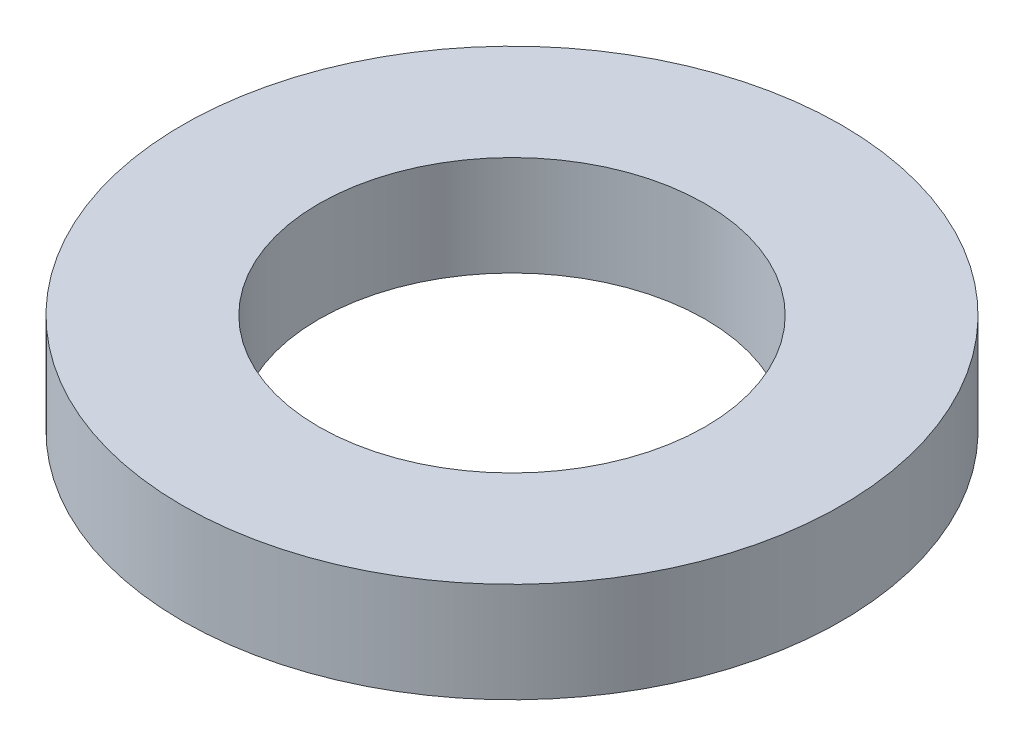
ISO-10303-21;
HEADER;
FILE_DESCRIPTION(('STEP AP214'),'2;1');
FILE_NAME('part.step','',(''),(''),'','','');
FILE_SCHEMA(('AUTOMOTIVE_DESIGN { 1 0 10303 214 1 1 1 1 }'));
ENDSEC;
DATA;
#1=APPLICATION_CONTEXT('core data for automotive mechanical design processes');
#2=APPLICATION_PROTOCOL_DEFINITION('international standard','automotive_design',2000,#1);
#3=PRODUCT_CONTEXT('',#1,'mechanical');
#4=PRODUCT('Part','Part','',(#3));
#5=PRODUCT_RELATED_PRODUCT_CATEGORY('part','',(#4));
#6=PRODUCT_DEFINITION_FORMATION('','',#4);
#7=PRODUCT_DEFINITION_CONTEXT('part definition',#1,'design');
#8=PRODUCT_DEFINITION('design','',#6,#7);
#9=PRODUCT_DEFINITION_SHAPE('','',#8);
#10=(LENGTH_UNIT() NAMED_UNIT(*) SI_UNIT(.MILLI.,.METRE.));
#11=(NAMED_UNIT(*) PLANE_ANGLE_UNIT() SI_UNIT($,.RADIAN.));
#12=(NAMED_UNIT(*) SI_UNIT($,.STERADIAN.) SOLID_ANGLE_UNIT());
#13=UNCERTAINTY_MEASURE_WITH_UNIT(LENGTH_MEASURE(1.E-05),#10,'distance_accuracy_value','');
#14=(GEOMETRIC_REPRESENTATION_CONTEXT(3) GLOBAL_UNCERTAINTY_ASSIGNED_CONTEXT((#13)) GLOBAL_UNIT_ASSIGNED_CONTEXT((#10,
#11,#12)) REPRESENTATION_CONTEXT('',''));
#15=CARTESIAN_POINT('',(0.,0.,0.));
#16=DIRECTION('',(0.,0.,1.));
#17=DIRECTION('',(1.,0.,0.));
#18=AXIS2_PLACEMENT_3D('',#15,#16,#17);
#19=CARTESIAN_POINT('',(0.,22.,0.));
#20=DIRECTION('',(0.,-1.,0.));
#21=DIRECTION('',(0.,0.,-1.));
#22=AXIS2_PLACEMENT_3D('',#19,#20,#21);
#23=CYLINDRICAL_SURFACE('',#22,72.5);
#24=CARTESIAN_POINT('',(0.,22.,0.));
#25=DIRECTION('',(0.,1.,0.));
#26=DIRECTION('',(0.,0.,1.));
#27=AXIS2_PLACEMENT_3D('',#24,#25,#26);
#28=CIRCLE('',#27,72.5);
#29=CARTESIAN_POINT('',(0.,22.,72.5));
#30=VERTEX_POINT('',#29);
#31=EDGE_CURVE('E10',#30,#30,#28,.T.);
#32=ORIENTED_EDGE('',*,*,#31,.F.);
#33=EDGE_LOOP('',(#32));
#34=FACE_BOUND('',#33,.T.);
#35=CARTESIAN_POINT('',(0.,0.,0.));
#36=DIRECTION('',(0.,1.,0.));
#37=DIRECTION('',(0.,0.,1.));
#38=AXIS2_PLACEMENT_3D('',#35,#36,#37);
#39=CIRCLE('',#38,72.5);
#40=CARTESIAN_POINT('',(0.,0.,72.5));
#41=VERTEX_POINT('',#40);
#42=EDGE_CURVE('E37',#41,#41,#39,.T.);
#43=ORIENTED_EDGE('',*,*,#42,.T.);
#44=EDGE_LOOP('',(#43));
#45=FACE_BOUND('',#44,.T.);
#46=ADVANCED_FACE('F40',(#34,#45),#23,.T.);
#47=CARTESIAN_POINT('',(0.,22.,0.));
#48=DIRECTION('',(0.,1.,0.));
#49=DIRECTION('',(0.,0.,1.));
#50=AXIS2_PLACEMENT_3D('',#47,#48,#49);
#51=PLANE('',#50);
#52=CARTESIAN_POINT('',(0.,22.,0.));
#53=DIRECTION('',(0.,1.,0.));
#54=DIRECTION('',(0.,0.,1.));
#55=AXIS2_PLACEMENT_3D('',#52,#53,#54);
#56=CIRCLE('',#55,42.5);
#57=CARTESIAN_POINT('',(0.,22.,42.5));
#58=VERTEX_POINT('',#57);
#59=EDGE_CURVE('E50',#58,#58,#56,.T.);
#60=ORIENTED_EDGE('',*,*,#59,.F.);
#61=EDGE_LOOP('',(#60));
#62=FACE_BOUND('',#61,.T.);
#63=ORIENTED_EDGE('',*,*,#31,.T.);
#64=EDGE_LOOP('',(#63));
#65=FACE_BOUND('',#64,.T.);
#66=ADVANCED_FACE('F59',(#62,#65),#51,.T.);
#67=CARTESIAN_POINT('',(0.,0.,0.));
#68=DIRECTION('',(0.,1.,0.));
#69=DIRECTION('',(0.,0.,1.));
#70=AXIS2_PLACEMENT_3D('',#67,#68,#69);
#71=PLANE('',#70);
#72=CARTESIAN_POINT('',(0.,0.,0.));
#73=DIRECTION('',(0.,1.,0.));
#74=DIRECTION('',(0.,0.,1.));
#75=AXIS2_PLACEMENT_3D('',#72,#73,#74);
#76=CIRCLE('',#75,42.5);
#77=CARTESIAN_POINT('',(0.,0.,42.5));
#78=VERTEX_POINT('',#77);
#79=EDGE_CURVE('E47',#78,#78,#76,.T.);
#80=ORIENTED_EDGE('',*,*,#79,.T.);
#81=EDGE_LOOP('',(#80));
#82=FACE_BOUND('',#81,.T.);
#83=ORIENTED_EDGE('',*,*,#42,.F.);
#84=EDGE_LOOP('',(#83));
#85=FACE_BOUND('',#84,.T.);
#86=ADVANCED_FACE('F58',(#82,#85),#71,.F.);
#87=CARTESIAN_POINT('',(0.,22.,0.));
#88=DIRECTION('',(0.,-1.,0.));
#89=DIRECTION('',(0.,0.,-1.));
#90=AXIS2_PLACEMENT_3D('',#87,#88,#89);
#91=CYLINDRICAL_SURFACE('',#90,42.5);
#92=ORIENTED_EDGE('',*,*,#59,.T.);
#93=EDGE_LOOP('',(#92));
#94=FACE_BOUND('',#93,.T.);
#95=ORIENTED_EDGE('',*,*,#79,.F.);
#96=EDGE_LOOP('',(#95));
#97=FACE_BOUND('',#96,.T.);
#98=ADVANCED_FACE('F54',(#94,#97),#91,.F.);
#99=CLOSED_SHELL('',(#46,#66,#86,#98));
#100=MANIFOLD_SOLID_BREP('B2',#99);
#101=ADVANCED_BREP_SHAPE_REPRESENTATION('',(#18,#100),#14);
#102=SHAPE_DEFINITION_REPRESENTATION(#9,#101);
ENDSEC;
END-ISO-10303-21;
